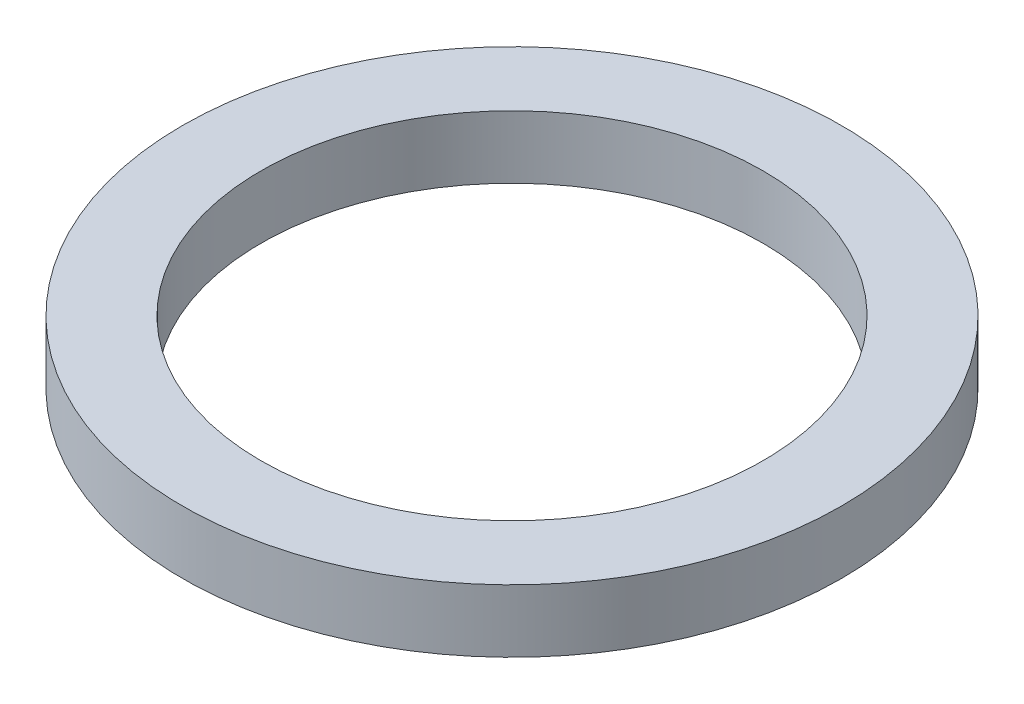
ISO-10303-21;
HEADER;
FILE_DESCRIPTION(('STEP AP214'),'2;1');
FILE_NAME('part.step','',(''),(''),'','','');
FILE_SCHEMA(('AUTOMOTIVE_DESIGN { 1 0 10303 214 1 1 1 1 }'));
ENDSEC;
DATA;
#1=APPLICATION_CONTEXT('core data for automotive mechanical design processes');
#2=APPLICATION_PROTOCOL_DEFINITION('international standard','automotive_design',2000,#1);
#3=PRODUCT_CONTEXT('',#1,'mechanical');
#4=PRODUCT('Part','Part','',(#3));
#5=PRODUCT_RELATED_PRODUCT_CATEGORY('part','',(#4));
#6=PRODUCT_DEFINITION_FORMATION('','',#4);
#7=PRODUCT_DEFINITION_CONTEXT('part definition',#1,'design');
#8=PRODUCT_DEFINITION('design','',#6,#7);
#9=PRODUCT_DEFINITION_SHAPE('','',#8);
#10=(LENGTH_UNIT() NAMED_UNIT(*) SI_UNIT(.MILLI.,.METRE.));
#11=(NAMED_UNIT(*) PLANE_ANGLE_UNIT() SI_UNIT($,.RADIAN.));
#12=(NAMED_UNIT(*) SI_UNIT($,.STERADIAN.) SOLID_ANGLE_UNIT());
#13=UNCERTAINTY_MEASURE_WITH_UNIT(LENGTH_MEASURE(1.E-05),#10,'distance_accuracy_value','');
#14=(GEOMETRIC_REPRESENTATION_CONTEXT(3) GLOBAL_UNCERTAINTY_ASSIGNED_CONTEXT((#13)) GLOBAL_UNIT_ASSIGNED_CONTEXT((#10,
#11,#12)) REPRESENTATION_CONTEXT('',''));
#15=CARTESIAN_POINT('',(0.,0.,0.));
#16=DIRECTION('',(0.,0.,1.));
#17=DIRECTION('',(1.,0.,0.));
#18=AXIS2_PLACEMENT_3D('',#15,#16,#17);
#19=CARTESIAN_POINT('',(0.,1.,0.));
#20=DIRECTION('',(0.,1.,0.));
#21=DIRECTION('',(0.,0.,1.));
#22=AXIS2_PLACEMENT_3D('',#19,#20,#21);
#23=PLANE('',#22);
#24=CARTESIAN_POINT('',(0.,1.,0.));
#25=DIRECTION('',(0.,1.,0.));
#26=DIRECTION('',(1.,0.,0.));
#27=AXIS2_PLACEMENT_3D('',#24,#25,#26);
#28=CIRCLE('',#27,5.25);
#29=CARTESIAN_POINT('',(5.25,1.,0.));
#30=VERTEX_POINT('',#29);
#31=EDGE_CURVE('E11',#30,#30,#28,.T.);
#32=ORIENTED_EDGE('',*,*,#31,.T.);
#33=EDGE_LOOP('',(#32));
#34=FACE_BOUND('',#33,.T.);
#35=CARTESIAN_POINT('',(0.,1.,0.));
#36=DIRECTION('',(0.,1.,0.));
#37=DIRECTION('',(0.,0.,1.));
#38=AXIS2_PLACEMENT_3D('',#35,#36,#37);
#39=CIRCLE('',#38,4.);
#40=CARTESIAN_POINT('',(0.,1.,4.));
#41=VERTEX_POINT('',#40);
#42=EDGE_CURVE('E56',#41,#41,#39,.T.);
#43=ORIENTED_EDGE('',*,*,#42,.F.);
#44=EDGE_LOOP('',(#43));
#45=FACE_BOUND('',#44,.T.);
#46=ADVANCED_FACE('F43',(#34,#45),#23,.T.);
#47=CARTESIAN_POINT('',(0.,0.,0.));
#48=DIRECTION('',(0.,1.,0.));
#49=DIRECTION('',(0.,0.,1.));
#50=AXIS2_PLACEMENT_3D('',#47,#48,#49);
#51=PLANE('',#50);
#52=CARTESIAN_POINT('',(0.,0.,0.));
#53=DIRECTION('',(0.,1.,0.));
#54=DIRECTION('',(1.,0.,0.));
#55=AXIS2_PLACEMENT_3D('',#52,#53,#54);
#56=CIRCLE('',#55,5.25);
#57=CARTESIAN_POINT('',(5.25,0.,0.));
#58=VERTEX_POINT('',#57);
#59=EDGE_CURVE('E47',#58,#58,#56,.T.);
#60=ORIENTED_EDGE('',*,*,#59,.F.);
#61=EDGE_LOOP('',(#60));
#62=FACE_BOUND('',#61,.T.);
#63=CARTESIAN_POINT('',(0.,0.,0.));
#64=DIRECTION('',(0.,1.,0.));
#65=DIRECTION('',(0.,0.,1.));
#66=AXIS2_PLACEMENT_3D('',#63,#64,#65);
#67=CIRCLE('',#66,4.);
#68=CARTESIAN_POINT('',(0.,0.,4.));
#69=VERTEX_POINT('',#68);
#70=EDGE_CURVE('E58',#69,#69,#67,.T.);
#71=ORIENTED_EDGE('',*,*,#70,.T.);
#72=EDGE_LOOP('',(#71));
#73=FACE_BOUND('',#72,.T.);
#74=ADVANCED_FACE('F70',(#62,#73),#51,.F.);
#75=CARTESIAN_POINT('',(0.,1.,0.));
#76=DIRECTION('',(0.,-1.,0.));
#77=DIRECTION('',(0.,0.,-1.));
#78=AXIS2_PLACEMENT_3D('',#75,#76,#77);
#79=CYLINDRICAL_SURFACE('',#78,5.25);
#80=ORIENTED_EDGE('',*,*,#31,.F.);
#81=EDGE_LOOP('',(#80));
#82=FACE_BOUND('',#81,.T.);
#83=ORIENTED_EDGE('',*,*,#59,.T.);
#84=EDGE_LOOP('',(#83));
#85=FACE_BOUND('',#84,.T.);
#86=ADVANCED_FACE('F45',(#82,#85),#79,.T.);
#87=CARTESIAN_POINT('',(0.,1.,0.));
#88=DIRECTION('',(0.,-1.,0.));
#89=DIRECTION('',(0.,0.,-1.));
#90=AXIS2_PLACEMENT_3D('',#87,#88,#89);
#91=CYLINDRICAL_SURFACE('',#90,4.);
#92=ORIENTED_EDGE('',*,*,#42,.T.);
#93=EDGE_LOOP('',(#92));
#94=FACE_BOUND('',#93,.T.);
#95=ORIENTED_EDGE('',*,*,#70,.F.);
#96=EDGE_LOOP('',(#95));
#97=FACE_BOUND('',#96,.T.);
#98=ADVANCED_FACE('F66',(#94,#97),#91,.F.);
#99=CLOSED_SHELL('',(#46,#74,#86,#98));
#100=MANIFOLD_SOLID_BREP('B2',#99);
#101=ADVANCED_BREP_SHAPE_REPRESENTATION('',(#18,#100),#14);
#102=SHAPE_DEFINITION_REPRESENTATION(#9,#101);
ENDSEC;
END-ISO-10303-21;
